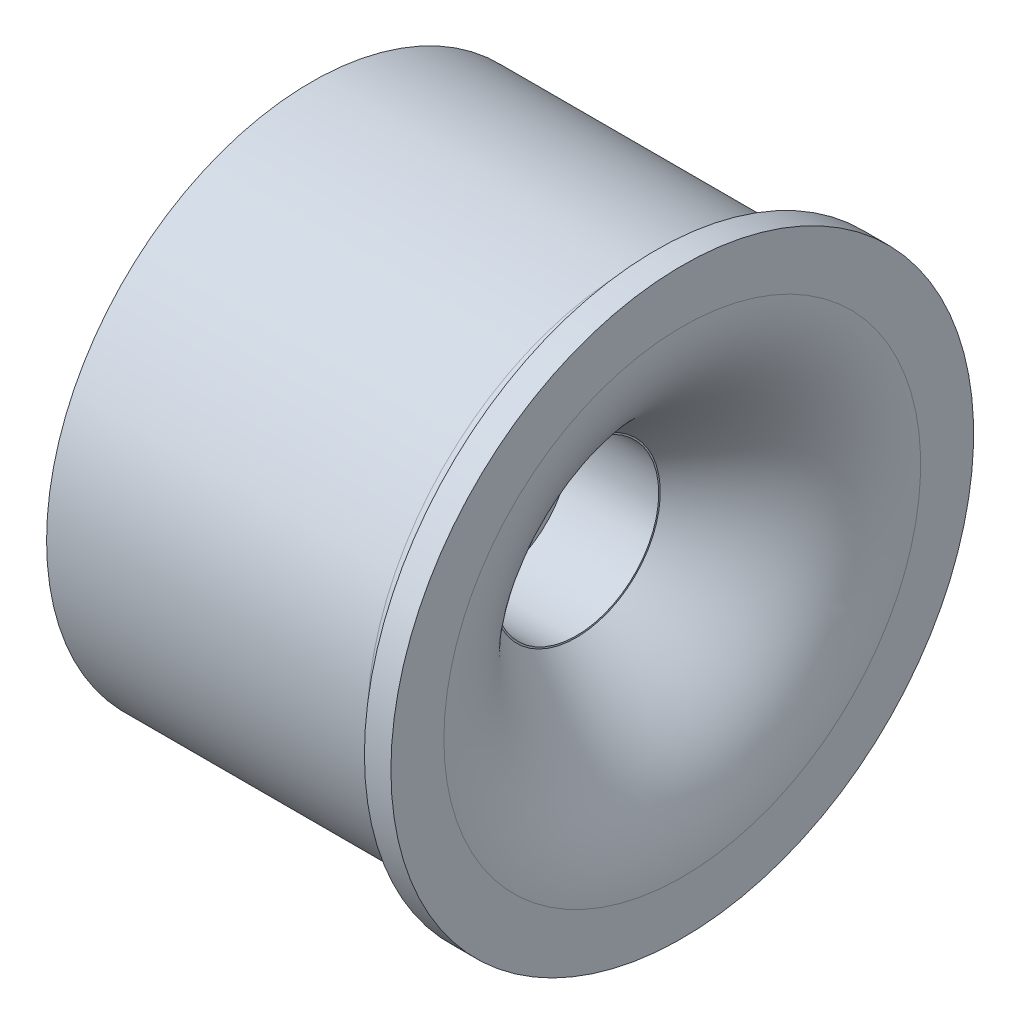
ISO-10303-21;
HEADER;
FILE_DESCRIPTION(('STEP AP214'),'2;1');
FILE_NAME('part.step','',(''),(''),'','','');
FILE_SCHEMA(('AUTOMOTIVE_DESIGN { 1 0 10303 214 1 1 1 1 }'));
ENDSEC;
DATA;
#1=APPLICATION_CONTEXT('core data for automotive mechanical design processes');
#2=APPLICATION_PROTOCOL_DEFINITION('international standard','automotive_design',2000,#1);
#3=PRODUCT_CONTEXT('',#1,'mechanical');
#4=PRODUCT('Part','Part','',(#3));
#5=PRODUCT_RELATED_PRODUCT_CATEGORY('part','',(#4));
#6=PRODUCT_DEFINITION_FORMATION('','',#4);
#7=PRODUCT_DEFINITION_CONTEXT('part definition',#1,'design');
#8=PRODUCT_DEFINITION('design','',#6,#7);
#9=PRODUCT_DEFINITION_SHAPE('','',#8);
#10=(LENGTH_UNIT() NAMED_UNIT(*) SI_UNIT(.MILLI.,.METRE.));
#11=(NAMED_UNIT(*) PLANE_ANGLE_UNIT() SI_UNIT($,.RADIAN.));
#12=(NAMED_UNIT(*) SI_UNIT($,.STERADIAN.) SOLID_ANGLE_UNIT());
#13=UNCERTAINTY_MEASURE_WITH_UNIT(LENGTH_MEASURE(1.E-05),#10,'distance_accuracy_value','');
#14=(GEOMETRIC_REPRESENTATION_CONTEXT(3) GLOBAL_UNCERTAINTY_ASSIGNED_CONTEXT((#13)) GLOBAL_UNIT_ASSIGNED_CONTEXT((#10,
#11,#12)) REPRESENTATION_CONTEXT('',''));
#15=CARTESIAN_POINT('',(0.,0.,0.));
#16=DIRECTION('',(0.,0.,1.));
#17=DIRECTION('',(1.,0.,0.));
#18=AXIS2_PLACEMENT_3D('',#15,#16,#17);
#19=CARTESIAN_POINT('',(-6.27882471877971,8.1,-8.52809647632307E-07));
#20=DIRECTION('',(1.,0.,0.));
#21=DIRECTION('',(0.,0.,-1.));
#22=AXIS2_PLACEMENT_3D('',#19,#20,#21);
#23=PLANE('',#22);
#24=CARTESIAN_POINT('',(-6.27882471877971,0.,-8.52809647632307E-07));
#25=DIRECTION('',(-1.,0.,0.));
#26=DIRECTION('',(0.,0.,1.));
#27=AXIS2_PLACEMENT_3D('',#24,#25,#26);
#28=CIRCLE('',#27,8.1);
#29=CARTESIAN_POINT('',(-6.27882471877971,0.,8.09999914719035));
#30=VERTEX_POINT('',#29);
#31=EDGE_CURVE('E39',#30,#30,#28,.T.);
#32=ORIENTED_EDGE('',*,*,#31,.F.);
#33=EDGE_LOOP('',(#32));
#34=FACE_BOUND('',#33,.T.);
#35=CARTESIAN_POINT('',(-6.27882471877971,0.,-8.52809647632307E-07));
#36=DIRECTION('',(1.,0.,0.));
#37=DIRECTION('',(0.,0.,-1.));
#38=AXIS2_PLACEMENT_3D('',#35,#36,#37);
#39=CIRCLE('',#38,9.);
#40=CARTESIAN_POINT('',(-6.27882471877971,0.,-9.00000085280965));
#41=VERTEX_POINT('',#40);
#42=EDGE_CURVE('E102',#41,#41,#39,.T.);
#43=ORIENTED_EDGE('',*,*,#42,.F.);
#44=EDGE_LOOP('',(#43));
#45=FACE_BOUND('',#44,.T.);
#46=ADVANCED_FACE('F32',(#34,#45),#23,.F.);
#47=CARTESIAN_POINT('',(0.021175281220291,0.9,-8.52809647632307E-07));
#48=CARTESIAN_POINT('',(0.0226224181562739,0.90124865253096,-8.52809647632307E-07));
#49=CARTESIAN_POINT('',(4.92725599420086,4.12360870990623,-8.52809647632307E-07));
#50=CARTESIAN_POINT('',(6.32117528122029,6.69419251780518,-8.52809647632307E-07));
#51=CARTESIAN_POINT('',(6.32117528122029,8.1,-8.52809647632307E-07));
#52=B_SPLINE_CURVE_WITH_KNOTS('',3,(#47,#48,#49,#50,#51),.UNSPECIFIED.,.F.,.F.,(4,1,4),(0.,
0.594098358034036,1.),.UNSPECIFIED.);
#53=CARTESIAN_POINT('',(0.0211752812202911,0.,-8.52809647632307E-07));
#54=DIRECTION('',(-1.,0.,0.));
#55=AXIS1_PLACEMENT('',#53,#54);
#56=SURFACE_OF_REVOLUTION('',#52,#55);
#57=CARTESIAN_POINT('',(6.32117528122029,0.,-8.52809647632307E-07));
#58=DIRECTION('',(-1.,0.,0.));
#59=DIRECTION('',(0.,0.,1.));
#60=AXIS2_PLACEMENT_3D('',#57,#58,#59);
#61=CIRCLE('',#60,8.1);
#62=CARTESIAN_POINT('',(6.32117528122029,0.,8.09999914719035));
#63=VERTEX_POINT('',#62);
#64=EDGE_CURVE('E160',#63,#63,#61,.T.);
#65=ORIENTED_EDGE('',*,*,#64,.F.);
#66=EDGE_LOOP('',(#65));
#67=FACE_BOUND('',#66,.T.);
#68=CARTESIAN_POINT('',(2.72117528122029,0.,-8.52809647632307E-07));
#69=DIRECTION('',(-1.,0.,0.));
#70=DIRECTION('',(0.,0.,1.));
#71=AXIS2_PLACEMENT_3D('',#68,#69,#70);
#72=CIRCLE('',#71,2.85290799158903);
#73=CARTESIAN_POINT('',(2.72117528122029,0.,2.85290713877939));
#74=VERTEX_POINT('',#73);
#75=EDGE_CURVE('E10',#74,#74,#72,.F.);
#76=ORIENTED_EDGE('',*,*,#75,.F.);
#77=EDGE_LOOP('',(#76));
#78=FACE_BOUND('',#77,.T.);
#79=ADVANCED_FACE('F82',(#67,#78),#56,.T.);
#80=CARTESIAN_POINT('',(0.0211752812202911,0.,-8.52809647632307E-07));
#81=DIRECTION('',(-1.,0.,0.));
#82=DIRECTION('',(0.,0.,1.));
#83=AXIS2_PLACEMENT_3D('',#80,#81,#82);
#84=CYLINDRICAL_SURFACE('',#83,8.1);
#85=CARTESIAN_POINT('',(4.52117528122029,0.,-8.52809647632307E-07));
#86=DIRECTION('',(-1.,0.,0.));
#87=DIRECTION('',(0.,0.,1.));
#88=AXIS2_PLACEMENT_3D('',#85,#86,#87);
#89=CIRCLE('',#88,8.1);
#90=CARTESIAN_POINT('',(4.52117528122029,0.,8.09999914719035));
#91=VERTEX_POINT('',#90);
#92=EDGE_CURVE('E44',#91,#91,#89,.T.);
#93=ORIENTED_EDGE('',*,*,#92,.F.);
#94=EDGE_LOOP('',(#93));
#95=FACE_BOUND('',#94,.T.);
#96=ORIENTED_EDGE('',*,*,#31,.T.);
#97=EDGE_LOOP('',(#96));
#98=FACE_BOUND('',#97,.T.);
#99=ADVANCED_FACE('F81',(#95,#98),#84,.F.);
#100=CARTESIAN_POINT('',(4.52117528122029,8.1,-8.52809647632307E-07));
#101=CARTESIAN_POINT('',(4.52117528122029,7.97081956297526,-8.52809647632307E-07));
#102=CARTESIAN_POINT('',(4.5037426279181,7.69737430007115,-8.52809647632307E-07));
#103=CARTESIAN_POINT('',(4.41304647794234,7.27731579323938,-8.52809647632307E-07));
#104=CARTESIAN_POINT('',(4.19496181473692,6.77547575048465,-8.52809647632307E-07));
#105=CARTESIAN_POINT('',(3.61761990700212,6.02114431531518,-8.52809647632307E-07));
#106=CARTESIAN_POINT('',(2.59605039601465,5.05687300481696,-8.52809647632307E-07));
#107=CARTESIAN_POINT('',(1.35179397112616,4.05359769157299,-8.52809647632307E-07));
#108=CARTESIAN_POINT('',(0.36097586320721,3.32419735240205,-8.52809647632307E-07));
#109=CARTESIAN_POINT('',(-0.285081391156655,2.86826773089546,-8.52809647632307E-07));
#110=CARTESIAN_POINT('',(-0.602601064204137,2.64983175171623,-8.52809647632307E-07));
#111=CARTESIAN_POINT('',(-0.790145227159541,2.52269203916731,-8.52809647632307E-07));
#112=CARTESIAN_POINT('',(-0.876610870708562,2.46465794944223,-8.52809647632307E-07));
#113=CARTESIAN_POINT('',(-0.925584423948169,2.43198700695974,-8.52809647632307E-07));
#114=CARTESIAN_POINT('',(-0.947444185842378,2.41746564613248,-8.52809647632307E-07));
#115=CARTESIAN_POINT('',(-0.959629316662147,2.4093907497313,-8.52809647632307E-07));
#116=CARTESIAN_POINT('',(-0.965088250852737,2.40577862509907,-8.52809647632307E-07));
#117=CARTESIAN_POINT('',(-0.968476237808899,2.40353768049811,-8.52809647632307E-07));
#118=CARTESIAN_POINT('',(-0.970380216910272,2.40227833309325,-8.52809647632307E-07));
#119=CARTESIAN_POINT('',(-0.972427773288695,2.40092205277232,-8.52809647632307E-07));
#120=CARTESIAN_POINT('',(-0.974322557181999,2.39966561811343,-8.52809647632307E-07));
#121=CARTESIAN_POINT('',(-0.97740595599445,2.39761343642498,-8.52809647632307E-07));
#122=CARTESIAN_POINT('',(-0.980762276093434,2.39537055712148,-8.52809647632307E-07));
#123=CARTESIAN_POINT('',(-0.986307784776445,2.39164432677015,-8.52809647632307E-07));
#124=CARTESIAN_POINT('',(-0.992455685473142,2.38746648746417,-8.52809647632307E-07));
#125=CARTESIAN_POINT('',(-1.00169330671363,2.38116090203438,-8.52809647632307E-07));
#126=CARTESIAN_POINT('',(-1.01433936539505,2.37228497239958,-8.52809647632307E-07));
#127=CARTESIAN_POINT('',(-1.03203656908312,2.3599962627208,-8.52809647632307E-07));
#128=CARTESIAN_POINT('',(-1.0676146895258,2.33344047708411,-8.52809647632307E-07));
#129=CARTESIAN_POINT('',(-1.09985516945983,2.30865658031782,-8.52809647632307E-07));
#130=CARTESIAN_POINT('',(-1.13856018664132,2.27676042917796,-8.52809647632307E-07));
#131=CARTESIAN_POINT('',(-1.15472136791711,2.26281586083646,-8.52809647632307E-07));
#132=B_SPLINE_CURVE_WITH_KNOTS('',3,(#100,#101,#102,#103,#104,#105,#106,#107,#108,#109,#110,
#111,#112,#113,#114,#115,#116,#117,#118,#119,#120,#121,#122,#123,#124,#125,#126,#127,#128,#129,
#130,#131),.UNSPECIFIED.,.F.,.F.,(4,1,1,1,1,1,1,1,1,1,1,1,1,1,1,1,1,1,1,1,1,1,1,1,1,1,1,1,1,4),
(0.,0.0625,0.125,0.25,0.375,0.5,0.625,0.75,0.8125,0.875,0.90625,0.9375,0.953125,0.96875,
0.9765625,0.984375,0.98828125,0.9921875,0.994140625,0.99609375,0.9970703125,0.998046875,
0.99853515625,0.9990234375,0.999267578125,0.99951171875,0.999755859375,0.9998779296875,
0.99993896484375,1.),.UNSPECIFIED.);
#133=CARTESIAN_POINT('',(0.0211752812202911,0.,-8.52809647632307E-07));
#134=DIRECTION('',(-1.,0.,0.));
#135=AXIS1_PLACEMENT('',#133,#134);
#136=SURFACE_OF_REVOLUTION('',#132,#135);
#137=CARTESIAN_POINT('',(2.44244016674252,0.,-8.52809647632307E-07));
#138=DIRECTION('',(-1.,0.,0.));
#139=DIRECTION('',(0.,0.,1.));
#140=AXIS2_PLACEMENT_3D('',#137,#138,#139);
#141=CIRCLE('',#140,4.95);
#142=CARTESIAN_POINT('',(2.44244016674252,0.,4.94999914719035));
#143=VERTEX_POINT('',#142);
#144=EDGE_CURVE('E47',#143,#143,#141,.F.);
#145=ORIENTED_EDGE('',*,*,#144,.T.);
#146=EDGE_LOOP('',(#145));
#147=FACE_BOUND('',#146,.T.);
#148=ORIENTED_EDGE('',*,*,#92,.T.);
#149=EDGE_LOOP('',(#148));
#150=FACE_BOUND('',#149,.T.);
#151=ADVANCED_FACE('F77',(#147,#150),#136,.T.);
#152=CARTESIAN_POINT('',(6.32117528122029,8.1,-8.52809647632307E-07));
#153=DIRECTION('',(-1.,0.,0.));
#154=DIRECTION('',(0.,0.,1.));
#155=AXIS2_PLACEMENT_3D('',#152,#153,#154);
#156=PLANE('',#155);
#157=CARTESIAN_POINT('',(6.32117528122029,0.,-8.52809647632307E-07));
#158=DIRECTION('',(-1.,0.,0.));
#159=DIRECTION('',(0.,0.,1.));
#160=AXIS2_PLACEMENT_3D('',#157,#158,#159);
#161=CIRCLE('',#160,9.9);
#162=CARTESIAN_POINT('',(6.32117528122029,0.,9.89999914719035));
#163=VERTEX_POINT('',#162);
#164=EDGE_CURVE('E157',#163,#163,#161,.T.);
#165=ORIENTED_EDGE('',*,*,#164,.F.);
#166=EDGE_LOOP('',(#165));
#167=FACE_BOUND('',#166,.T.);
#168=ORIENTED_EDGE('',*,*,#64,.T.);
#169=EDGE_LOOP('',(#168));
#170=FACE_BOUND('',#169,.T.);
#171=ADVANCED_FACE('F80',(#167,#170),#156,.F.);
#172=CARTESIAN_POINT('',(0.0211752812202911,0.,-8.52809647632307E-07));
#173=DIRECTION('',(-1.,0.,0.));
#174=DIRECTION('',(0.,0.,1.));
#175=AXIS2_PLACEMENT_3D('',#172,#173,#174);
#176=CYLINDRICAL_SURFACE('',#175,9.9);
#177=CARTESIAN_POINT('',(5.42117528122029,0.,-8.52809647632307E-07));
#178=DIRECTION('',(-1.,0.,0.));
#179=DIRECTION('',(0.,0.,1.));
#180=AXIS2_PLACEMENT_3D('',#177,#178,#179);
#181=CIRCLE('',#180,9.9);
#182=CARTESIAN_POINT('',(5.42117528122029,0.,9.89999914719035));
#183=VERTEX_POINT('',#182);
#184=EDGE_CURVE('E163',#183,#183,#181,.T.);
#185=ORIENTED_EDGE('',*,*,#184,.F.);
#186=EDGE_LOOP('',(#185));
#187=FACE_BOUND('',#186,.T.);
#188=ORIENTED_EDGE('',*,*,#164,.T.);
#189=EDGE_LOOP('',(#188));
#190=FACE_BOUND('',#189,.T.);
#191=ADVANCED_FACE('F146',(#187,#190),#176,.T.);
#192=CARTESIAN_POINT('',(5.42117528122029,9.9,-8.52809647632307E-07));
#193=DIRECTION('',(1.,0.,0.));
#194=DIRECTION('',(0.,0.,-1.));
#195=AXIS2_PLACEMENT_3D('',#192,#193,#194);
#196=PLANE('',#195);
#197=CARTESIAN_POINT('',(5.42117528122029,0.,-8.52809647632307E-07));
#198=DIRECTION('',(-1.,0.,0.));
#199=DIRECTION('',(0.,0.,1.));
#200=AXIS2_PLACEMENT_3D('',#197,#198,#199);
#201=CIRCLE('',#200,9.81);
#202=CARTESIAN_POINT('',(5.42117528122029,0.,9.80999914719036));
#203=VERTEX_POINT('',#202);
#204=EDGE_CURVE('E54',#203,#203,#201,.T.);
#205=ORIENTED_EDGE('',*,*,#204,.F.);
#206=EDGE_LOOP('',(#205));
#207=FACE_BOUND('',#206,.T.);
#208=ORIENTED_EDGE('',*,*,#184,.T.);
#209=EDGE_LOOP('',(#208));
#210=FACE_BOUND('',#209,.T.);
#211=ADVANCED_FACE('F142',(#207,#210),#196,.F.);
#212=CARTESIAN_POINT('',(4.61117528122029,0.,-8.52809647632307E-07));
#213=DIRECTION('',(-1.,0.,0.));
#214=DIRECTION('',(0.,0.,1.));
#215=AXIS2_PLACEMENT_3D('',#212,#213,#214);
#216=TOROIDAL_SURFACE('',#215,9.81,0.81);
#217=CARTESIAN_POINT('',(4.61117528122029,0.,-8.52809647632307E-07));
#218=DIRECTION('',(-1.,0.,0.));
#219=DIRECTION('',(0.,0.,1.));
#220=AXIS2_PLACEMENT_3D('',#217,#218,#219);
#221=CIRCLE('',#220,9.);
#222=CARTESIAN_POINT('',(4.61117528122029,0.,8.99999914719035));
#223=VERTEX_POINT('',#222);
#224=EDGE_CURVE('E49',#223,#223,#221,.T.);
#225=ORIENTED_EDGE('',*,*,#224,.F.);
#226=EDGE_LOOP('',(#225));
#227=FACE_BOUND('',#226,.T.);
#228=ORIENTED_EDGE('',*,*,#204,.T.);
#229=EDGE_LOOP('',(#228));
#230=FACE_BOUND('',#229,.T.);
#231=ADVANCED_FACE('F138',(#227,#230),#216,.F.);
#232=CARTESIAN_POINT('',(0.0211752812202911,0.,-8.52809647632307E-07));
#233=DIRECTION('',(-1.,0.,0.));
#234=DIRECTION('',(0.,0.,1.));
#235=AXIS2_PLACEMENT_3D('',#232,#233,#234);
#236=CYLINDRICAL_SURFACE('',#235,9.);
#237=ORIENTED_EDGE('',*,*,#224,.T.);
#238=EDGE_LOOP('',(#237));
#239=FACE_BOUND('',#238,.T.);
#240=ORIENTED_EDGE('',*,*,#42,.T.);
#241=EDGE_LOOP('',(#240));
#242=FACE_BOUND('',#241,.T.);
#243=ADVANCED_FACE('F130',(#239,#242),#236,.T.);
#244=CARTESIAN_POINT('',(2.72117528122029,0.,-8.52809647632307E-07));
#245=DIRECTION('',(-1.,0.,0.));
#246=DIRECTION('',(0.,0.,1.));
#247=AXIS2_PLACEMENT_3D('',#244,#245,#246);
#248=CYLINDRICAL_SURFACE('',#247,4.95);
#249=CARTESIAN_POINT('',(-6.27882471877971,0.,-8.52809647632307E-07));
#250=DIRECTION('',(-1.,0.,0.));
#251=DIRECTION('',(0.,0.,1.));
#252=AXIS2_PLACEMENT_3D('',#249,#250,#251);
#253=CIRCLE('',#252,4.95);
#254=CARTESIAN_POINT('',(-6.27882471877971,0.,4.94999914719035));
#255=VERTEX_POINT('',#254);
#256=EDGE_CURVE('E50',#255,#255,#253,.T.);
#257=ORIENTED_EDGE('',*,*,#256,.F.);
#258=EDGE_LOOP('',(#257));
#259=FACE_BOUND('',#258,.T.);
#260=ORIENTED_EDGE('',*,*,#144,.F.);
#261=EDGE_LOOP('',(#260));
#262=FACE_BOUND('',#261,.T.);
#263=ADVANCED_FACE('F121',(#259,#262),#248,.T.);
#264=CARTESIAN_POINT('',(2.72117528122029,0.,-8.52809647632307E-07));
#265=DIRECTION('',(-1.,0.,0.));
#266=DIRECTION('',(0.,0.,1.));
#267=AXIS2_PLACEMENT_3D('',#264,#265,#266);
#268=PLANE('',#267);
#269=CARTESIAN_POINT('',(2.72117528122029,0.,0.));
#270=DIRECTION('',(1.,0.,0.));
#271=DIRECTION('',(0.,0.,-1.));
#272=AXIS2_PLACEMENT_3D('',#269,#270,#271);
#273=CIRCLE('',#272,2.8);
#274=CARTESIAN_POINT('',(2.72117528122029,0.,-2.8));
#275=VERTEX_POINT('',#274);
#276=EDGE_CURVE('E62',#275,#275,#273,.T.);
#277=ORIENTED_EDGE('',*,*,#276,.F.);
#278=EDGE_LOOP('',(#277));
#279=FACE_BOUND('',#278,.T.);
#280=ORIENTED_EDGE('',*,*,#75,.T.);
#281=EDGE_LOOP('',(#280));
#282=FACE_BOUND('',#281,.T.);
#283=ADVANCED_FACE('F118',(#279,#282),#268,.F.);
#284=CARTESIAN_POINT('',(-6.27882471877971,0.,-8.52809647632307E-07));
#285=DIRECTION('',(-1.,0.,0.));
#286=DIRECTION('',(0.,0.,1.));
#287=AXIS2_PLACEMENT_3D('',#284,#285,#286);
#288=PLANE('',#287);
#289=CARTESIAN_POINT('',(-6.27882471877971,0.,-8.52809647632307E-07));
#290=DIRECTION('',(-1.,0.,0.));
#291=DIRECTION('',(0.,0.,1.));
#292=AXIS2_PLACEMENT_3D('',#289,#290,#291);
#293=CIRCLE('',#292,1.42);
#294=CARTESIAN_POINT('',(-6.27882471877971,0.,1.41999914719035));
#295=VERTEX_POINT('',#294);
#296=EDGE_CURVE('E104',#295,#295,#293,.T.);
#297=ORIENTED_EDGE('',*,*,#296,.F.);
#298=EDGE_LOOP('',(#297));
#299=FACE_BOUND('',#298,.T.);
#300=ORIENTED_EDGE('',*,*,#256,.T.);
#301=EDGE_LOOP('',(#300));
#302=FACE_BOUND('',#301,.T.);
#303=ADVANCED_FACE('F120',(#299,#302),#288,.T.);
#304=CARTESIAN_POINT('',(-0.278824718779709,0.,0.));
#305=DIRECTION('',(1.,0.,0.));
#306=DIRECTION('',(0.,0.,-1.));
#307=AXIS2_PLACEMENT_3D('',#304,#305,#306);
#308=PLANE('',#307);
#309=CARTESIAN_POINT('',(-0.278824718779709,0.,-8.52809647632307E-07));
#310=DIRECTION('',(1.,0.,0.));
#311=DIRECTION('',(0.,0.,-1.));
#312=AXIS2_PLACEMENT_3D('',#309,#310,#311);
#313=CIRCLE('',#312,1.42);
#314=CARTESIAN_POINT('',(-0.27882471877971,0.,1.41999914719035));
#315=VERTEX_POINT('',#314);
#316=EDGE_CURVE('E35',#315,#315,#313,.T.);
#317=ORIENTED_EDGE('',*,*,#316,.F.);
#318=EDGE_LOOP('',(#317));
#319=FACE_BOUND('',#318,.T.);
#320=CARTESIAN_POINT('',(-0.278824718779709,0.,0.));
#321=DIRECTION('',(1.,0.,0.));
#322=DIRECTION('',(0.,0.,-1.));
#323=AXIS2_PLACEMENT_3D('',#320,#321,#322);
#324=CIRCLE('',#323,2.8);
#325=CARTESIAN_POINT('',(-0.278824718779709,0.,-2.8));
#326=VERTEX_POINT('',#325);
#327=EDGE_CURVE('E57',#326,#326,#324,.T.);
#328=ORIENTED_EDGE('',*,*,#327,.T.);
#329=EDGE_LOOP('',(#328));
#330=FACE_BOUND('',#329,.T.);
#331=ADVANCED_FACE('F127',(#319,#330),#308,.T.);
#332=CARTESIAN_POINT('',(-0.278824718779709,0.,0.));
#333=DIRECTION('',(1.,0.,0.));
#334=DIRECTION('',(0.,0.,-1.));
#335=AXIS2_PLACEMENT_3D('',#332,#333,#334);
#336=CYLINDRICAL_SURFACE('',#335,2.8);
#337=ORIENTED_EDGE('',*,*,#327,.F.);
#338=EDGE_LOOP('',(#337));
#339=FACE_BOUND('',#338,.T.);
#340=ORIENTED_EDGE('',*,*,#276,.T.);
#341=EDGE_LOOP('',(#340));
#342=FACE_BOUND('',#341,.T.);
#343=ADVANCED_FACE('F116',(#339,#342),#336,.F.);
#344=CARTESIAN_POINT('',(0.72117528122029,0.,-8.52809647632307E-07));
#345=DIRECTION('',(-1.,0.,0.));
#346=DIRECTION('',(0.,0.,1.));
#347=AXIS2_PLACEMENT_3D('',#344,#345,#346);
#348=CYLINDRICAL_SURFACE('',#347,1.42);
#349=CARTESIAN_POINT('',(-0.27882471877971,0.,1.41999914719035));
#350=CARTESIAN_POINT('',(-0.34132471877971,0.,1.41999914719035));
#351=CARTESIAN_POINT('',(-0.40382471877971,0.,1.41999914719035));
#352=CARTESIAN_POINT('',(-0.528824718779709,0.,1.41999914719035));
#353=CARTESIAN_POINT('',(-0.591324718779709,0.,1.41999914719035));
#354=CARTESIAN_POINT('',(-0.716324718779709,0.,1.41999914719035));
#355=CARTESIAN_POINT('',(-0.77882471877971,0.,1.41999914719035));
#356=CARTESIAN_POINT('',(-0.903824718779709,0.,1.41999914719035));
#357=CARTESIAN_POINT('',(-0.966324718779709,0.,1.41999914719035));
#358=CARTESIAN_POINT('',(-1.09132471877971,0.,1.41999914719035));
#359=CARTESIAN_POINT('',(-1.15382471877971,0.,1.41999914719035));
#360=CARTESIAN_POINT('',(-1.27882471877971,0.,1.41999914719035));
#361=CARTESIAN_POINT('',(-1.34132471877971,0.,1.41999914719035));
#362=CARTESIAN_POINT('',(-1.46632471877971,0.,1.41999914719035));
#363=CARTESIAN_POINT('',(-1.52882471877971,0.,1.41999914719035));
#364=CARTESIAN_POINT('',(-1.65382471877971,0.,1.41999914719035));
#365=CARTESIAN_POINT('',(-1.71632471877971,0.,1.41999914719035));
#366=CARTESIAN_POINT('',(-1.84132471877971,0.,1.41999914719035));
#367=CARTESIAN_POINT('',(-1.90382471877971,0.,1.41999914719035));
#368=CARTESIAN_POINT('',(-2.02882471877971,0.,1.41999914719035));
#369=CARTESIAN_POINT('',(-2.09132471877971,0.,1.41999914719035));
#370=CARTESIAN_POINT('',(-2.21632471877971,0.,1.41999914719035));
#371=CARTESIAN_POINT('',(-2.27882471877971,0.,1.41999914719035));
#372=CARTESIAN_POINT('',(-2.40382471877971,0.,1.41999914719035));
#373=CARTESIAN_POINT('',(-2.46632471877971,0.,1.41999914719035));
#374=CARTESIAN_POINT('',(-2.59132471877971,0.,1.41999914719035));
#375=CARTESIAN_POINT('',(-2.65382471877971,0.,1.41999914719035));
#376=CARTESIAN_POINT('',(-2.77882471877971,0.,1.41999914719035));
#377=CARTESIAN_POINT('',(-2.84132471877971,0.,1.41999914719035));
#378=CARTESIAN_POINT('',(-2.96632471877971,0.,1.41999914719035));
#379=CARTESIAN_POINT('',(-3.02882471877971,0.,1.41999914719035));
#380=CARTESIAN_POINT('',(-3.15382471877971,0.,1.41999914719035));
#381=CARTESIAN_POINT('',(-3.21632471877971,0.,1.41999914719035));
#382=CARTESIAN_POINT('',(-3.34132471877971,0.,1.41999914719035));
#383=CARTESIAN_POINT('',(-3.40382471877971,0.,1.41999914719035));
#384=CARTESIAN_POINT('',(-3.52882471877971,0.,1.41999914719035));
#385=CARTESIAN_POINT('',(-3.59132471877971,0.,1.41999914719035));
#386=CARTESIAN_POINT('',(-3.71632471877971,0.,1.41999914719035));
#387=CARTESIAN_POINT('',(-3.77882471877971,0.,1.41999914719035));
#388=CARTESIAN_POINT('',(-3.90382471877971,0.,1.41999914719035));
#389=CARTESIAN_POINT('',(-3.96632471877971,0.,1.41999914719035));
#390=CARTESIAN_POINT('',(-4.09132471877971,0.,1.41999914719035));
#391=CARTESIAN_POINT('',(-4.15382471877971,0.,1.41999914719035));
#392=CARTESIAN_POINT('',(-4.27882471877971,0.,1.41999914719035));
#393=CARTESIAN_POINT('',(-4.34132471877971,0.,1.41999914719035));
#394=CARTESIAN_POINT('',(-4.46632471877971,0.,1.41999914719035));
#395=CARTESIAN_POINT('',(-4.52882471877971,0.,1.41999914719035));
#396=CARTESIAN_POINT('',(-4.65382471877971,0.,1.41999914719035));
#397=CARTESIAN_POINT('',(-4.71632471877971,0.,1.41999914719035));
#398=CARTESIAN_POINT('',(-4.84132471877971,0.,1.41999914719035));
#399=CARTESIAN_POINT('',(-4.90382471877971,0.,1.41999914719035));
#400=CARTESIAN_POINT('',(-5.02882471877971,0.,1.41999914719035));
#401=CARTESIAN_POINT('',(-5.09132471877971,0.,1.41999914719035));
#402=CARTESIAN_POINT('',(-5.21632471877971,0.,1.41999914719035));
#403=CARTESIAN_POINT('',(-5.27882471877971,0.,1.41999914719035));
#404=CARTESIAN_POINT('',(-5.40382471877971,0.,1.41999914719035));
#405=CARTESIAN_POINT('',(-5.46632471877971,0.,1.41999914719035));
#406=CARTESIAN_POINT('',(-5.59132471877971,0.,1.41999914719035));
#407=CARTESIAN_POINT('',(-5.65382471877971,0.,1.41999914719035));
#408=CARTESIAN_POINT('',(-5.77882471877971,0.,1.41999914719035));
#409=CARTESIAN_POINT('',(-5.84132471877971,0.,1.41999914719035));
#410=CARTESIAN_POINT('',(-5.96632471877971,0.,1.41999914719035));
#411=CARTESIAN_POINT('',(-6.02882471877971,0.,1.41999914719035));
#412=CARTESIAN_POINT('',(-6.15382471877971,0.,1.41999914719035));
#413=CARTESIAN_POINT('',(-6.21632471877971,0.,1.41999914719035));
#414=CARTESIAN_POINT('',(-6.27882471877971,0.,1.41999914719035));
#415=B_SPLINE_CURVE_WITH_KNOTS('',3,(#349,#350,#351,#352,#353,#354,#355,#356,#357,#358,#359,
#360,#361,#362,#363,#364,#365,#366,#367,#368,#369,#370,#371,#372,#373,#374,#375,#376,#377,#378,
#379,#380,#381,#382,#383,#384,#385,#386,#387,#388,#389,#390,#391,#392,#393,#394,#395,#396,#397,
#398,#399,#400,#401,#402,#403,#404,#405,#406,#407,#408,#409,#410,#411,#412,#413,#414),
.UNSPECIFIED.,.F.,.F.,(4,2,2,2,2,2,2,2,2,2,2,2,2,2,2,2,2,2,2,2,2,2,2,2,2,2,2,2,2,2,2,2,4),(0.,
0.1875,0.375,0.5625,0.75,0.9375,1.125,1.3125,1.5,1.6875,1.875,2.0625,2.25,2.4375,2.625,2.8125,
3.,3.1875,3.375,3.5625,3.75,3.9375,4.125,4.3125,4.5,4.6875,4.875,5.0625,5.25,5.4375,5.625,
5.8125,6.),.UNSPECIFIED.);
#416=EDGE_CURVE('BSEAM209',#315,#295,#415,.T.);
#417=ORIENTED_EDGE('',*,*,#316,.T.);
#418=ORIENTED_EDGE('',*,*,#296,.T.);
#419=ORIENTED_EDGE('',*,*,#416,.T.);
#420=ORIENTED_EDGE('',*,*,#416,.F.);
#421=EDGE_LOOP('',(#417,#419,#418,#420));
#422=FACE_BOUND('',#421,.T.);
#423=ADVANCED_FACE('F209',(#422),#348,.F.);
#424=CLOSED_SHELL('',(#46,#79,#99,#151,#171,#191,#211,#231,#243,#263,#283,#303,#331,#343,#423));
#425=MANIFOLD_SOLID_BREP('B2',#424);
#426=ADVANCED_BREP_SHAPE_REPRESENTATION('',(#18,#425),#14);
#427=SHAPE_DEFINITION_REPRESENTATION(#9,#426);
ENDSEC;
END-ISO-10303-21;
